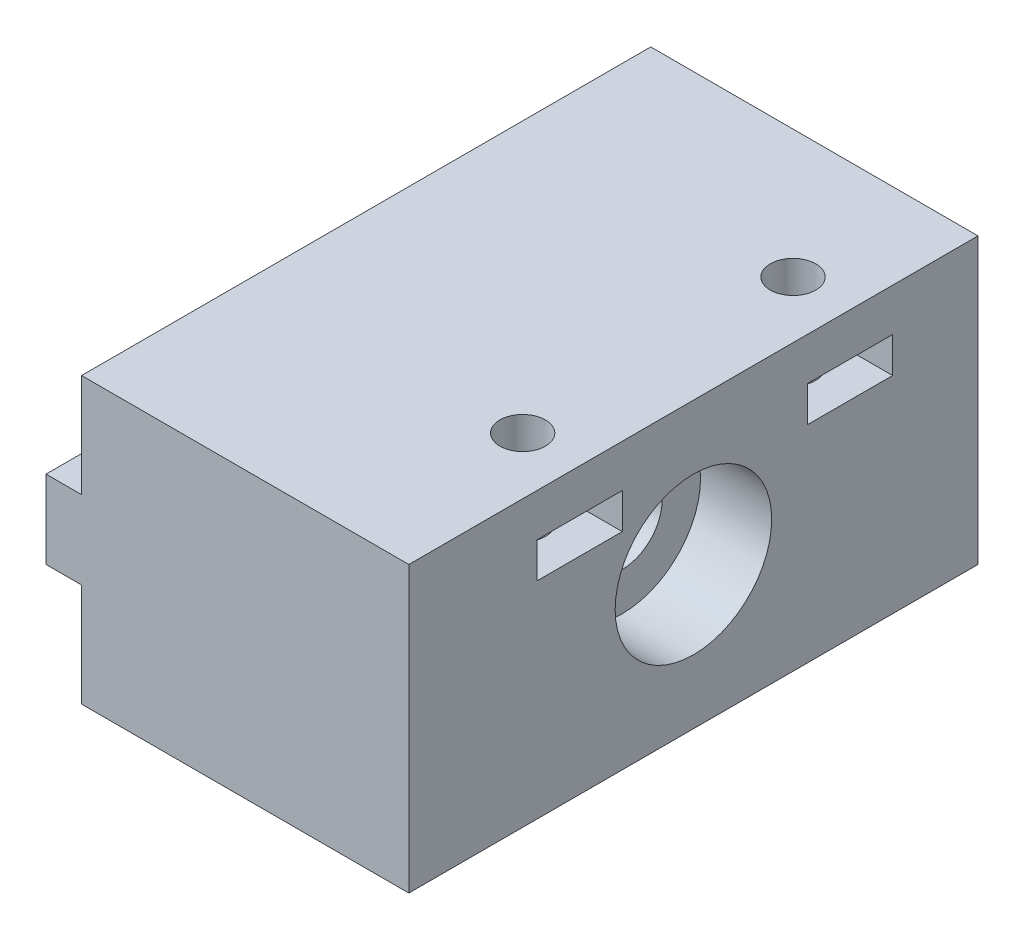
ISO-10303-21;
HEADER;
FILE_DESCRIPTION(('STEP AP214'),'2;1');
FILE_NAME('part.step','',(''),(''),'','','');
FILE_SCHEMA(('AUTOMOTIVE_DESIGN { 1 0 10303 214 1 1 1 1 }'));
ENDSEC;
DATA;
#1=APPLICATION_CONTEXT('core data for automotive mechanical design processes');
#2=APPLICATION_PROTOCOL_DEFINITION('international standard','automotive_design',2000,#1);
#3=PRODUCT_CONTEXT('',#1,'mechanical');
#4=PRODUCT('Part','Part','',(#3));
#5=PRODUCT_RELATED_PRODUCT_CATEGORY('part','',(#4));
#6=PRODUCT_DEFINITION_FORMATION('','',#4);
#7=PRODUCT_DEFINITION_CONTEXT('part definition',#1,'design');
#8=PRODUCT_DEFINITION('design','',#6,#7);
#9=PRODUCT_DEFINITION_SHAPE('','',#8);
#10=(LENGTH_UNIT() NAMED_UNIT(*) SI_UNIT(.MILLI.,.METRE.));
#11=(NAMED_UNIT(*) PLANE_ANGLE_UNIT() SI_UNIT($,.RADIAN.));
#12=(NAMED_UNIT(*) SI_UNIT($,.STERADIAN.) SOLID_ANGLE_UNIT());
#13=UNCERTAINTY_MEASURE_WITH_UNIT(LENGTH_MEASURE(1.E-05),#10,'distance_accuracy_value','');
#14=(GEOMETRIC_REPRESENTATION_CONTEXT(3) GLOBAL_UNCERTAINTY_ASSIGNED_CONTEXT((#13)) GLOBAL_UNIT_ASSIGNED_CONTEXT((#10,
#11,#12)) REPRESENTATION_CONTEXT('',''));
#15=CARTESIAN_POINT('',(0.,0.,0.));
#16=DIRECTION('',(0.,0.,1.));
#17=DIRECTION('',(1.,0.,0.));
#18=AXIS2_PLACEMENT_3D('',#15,#16,#17);
#19=CARTESIAN_POINT('',(-0.696758220439547,20.,0.));
#20=DIRECTION('',(1.,0.,0.));
#21=DIRECTION('',(0.,0.,-1.));
#22=AXIS2_PLACEMENT_3D('',#19,#20,#21);
#23=PLANE('',#22);
#24=CARTESIAN_POINT('',(-0.696758220439547,10.,-20.));
#25=DIRECTION('',(-1.,0.,0.));
#26=DIRECTION('',(0.,0.,1.));
#27=AXIS2_PLACEMENT_3D('',#24,#25,#26);
#28=CIRCLE('',#27,2.80000000000001);
#29=CARTESIAN_POINT('',(-0.696758220439547,10.,-17.2));
#30=VERTEX_POINT('',#29);
#31=EDGE_CURVE('E231',#30,#30,#28,.T.);
#32=ORIENTED_EDGE('',*,*,#31,.F.);
#33=EDGE_LOOP('',(#32));
#34=FACE_BOUND('',#33,.T.);
#35=DIRECTION('',(0.,0.,1.));
#36=VECTOR('',#35,1.);
#37=CARTESIAN_POINT('',(-0.696758220439547,7.25,-13.));
#38=LINE('',#37,#36);
#39=CARTESIAN_POINT('',(-0.696758220439547,7.25,-13.));
#40=VERTEX_POINT('',#39);
#41=CARTESIAN_POINT('',(-0.696758220439547,7.25,0.));
#42=VERTEX_POINT('',#41);
#43=EDGE_CURVE('E51',#40,#42,#38,.T.);
#44=ORIENTED_EDGE('',*,*,#43,.F.);
#45=DIRECTION('',(0.,-1.,0.));
#46=VECTOR('',#45,1.);
#47=CARTESIAN_POINT('',(-0.696758220439547,12.75,-13.));
#48=LINE('',#47,#46);
#49=CARTESIAN_POINT('',(-0.696758220439547,12.75,-13.));
#50=VERTEX_POINT('',#49);
#51=EDGE_CURVE('E190',#50,#40,#48,.T.);
#52=ORIENTED_EDGE('',*,*,#51,.F.);
#53=DIRECTION('',(0.,0.,-1.));
#54=VECTOR('',#53,1.);
#55=CARTESIAN_POINT('',(-0.696758220439547,12.75,-13.));
#56=LINE('',#55,#54);
#57=CARTESIAN_POINT('',(-0.696758220439547,12.75,0.));
#58=VERTEX_POINT('',#57);
#59=EDGE_CURVE('E382',#58,#50,#56,.T.);
#60=ORIENTED_EDGE('',*,*,#59,.F.);
#61=DIRECTION('',(0.,-1.,0.));
#62=VECTOR('',#61,1.);
#63=CARTESIAN_POINT('',(-0.696758220439547,20.,0.));
#64=LINE('',#63,#62);
#65=CARTESIAN_POINT('',(-0.696758220439547,20.,0.));
#66=VERTEX_POINT('',#65);
#67=EDGE_CURVE('E11',#66,#58,#64,.T.);
#68=ORIENTED_EDGE('',*,*,#67,.F.);
#69=DIRECTION('',(0.,0.,1.));
#70=VECTOR('',#69,1.);
#71=CARTESIAN_POINT('',(-0.696758220439547,20.,0.));
#72=LINE('',#71,#70);
#73=CARTESIAN_POINT('',(-0.696758220439547,20.,-40.));
#74=VERTEX_POINT('',#73);
#75=EDGE_CURVE('E315',#74,#66,#72,.T.);
#76=ORIENTED_EDGE('',*,*,#75,.F.);
#77=DIRECTION('',(0.,-1.,0.));
#78=VECTOR('',#77,1.);
#79=CARTESIAN_POINT('',(-0.696758220439547,20.,-40.));
#80=LINE('',#79,#78);
#81=CARTESIAN_POINT('',(-0.696758220439547,12.75,-40.));
#82=VERTEX_POINT('',#81);
#83=EDGE_CURVE('E334',#74,#82,#80,.T.);
#84=ORIENTED_EDGE('',*,*,#83,.T.);
#85=DIRECTION('',(0.,0.,-1.));
#86=VECTOR('',#85,1.);
#87=CARTESIAN_POINT('',(-0.696758220439547,12.75,-40.));
#88=LINE('',#87,#86);
#89=CARTESIAN_POINT('',(-0.696758220439547,12.75,-27.));
#90=VERTEX_POINT('',#89);
#91=EDGE_CURVE('E59',#90,#82,#88,.T.);
#92=ORIENTED_EDGE('',*,*,#91,.F.);
#93=DIRECTION('',(0.,1.,0.));
#94=VECTOR('',#93,1.);
#95=CARTESIAN_POINT('',(-0.696758220439547,12.75,-27.));
#96=LINE('',#95,#94);
#97=CARTESIAN_POINT('',(-0.696758220439547,7.25,-27.));
#98=VERTEX_POINT('',#97);
#99=EDGE_CURVE('E196',#98,#90,#96,.T.);
#100=ORIENTED_EDGE('',*,*,#99,.F.);
#101=DIRECTION('',(0.,0.,1.));
#102=VECTOR('',#101,1.);
#103=CARTESIAN_POINT('',(-0.696758220439547,7.25,-40.));
#104=LINE('',#103,#102);
#105=CARTESIAN_POINT('',(-0.696758220439547,7.25,-40.));
#106=VERTEX_POINT('',#105);
#107=EDGE_CURVE('E193',#106,#98,#104,.T.);
#108=ORIENTED_EDGE('',*,*,#107,.F.);
#109=CARTESIAN_POINT('',(-0.696758220439547,0.,-40.));
#110=VERTEX_POINT('',#109);
#111=EDGE_CURVE('E325',#106,#110,#80,.T.);
#112=ORIENTED_EDGE('',*,*,#111,.T.);
#113=DIRECTION('',(0.,0.,1.));
#114=VECTOR('',#113,1.);
#115=CARTESIAN_POINT('',(-0.696758220439547,0.,0.));
#116=LINE('',#115,#114);
#117=CARTESIAN_POINT('',(-0.696758220439547,0.,0.));
#118=VERTEX_POINT('',#117);
#119=EDGE_CURVE('E312',#110,#118,#116,.T.);
#120=ORIENTED_EDGE('',*,*,#119,.T.);
#121=EDGE_CURVE('E43',#42,#118,#64,.T.);
#122=ORIENTED_EDGE('',*,*,#121,.F.);
#123=EDGE_LOOP('',(#44,#52,#60,#68,#76,#84,#92,#100,#108,#112,#120,#122));
#124=FACE_BOUND('',#123,.T.);
#125=ADVANCED_FACE('F35',(#34,#124),#23,.F.);
#126=CARTESIAN_POINT('',(22.3032417795605,10.,-20.));
#127=DIRECTION('',(-1.,0.,0.));
#128=DIRECTION('',(0.,0.,1.));
#129=AXIS2_PLACEMENT_3D('',#126,#127,#128);
#130=CYLINDRICAL_SURFACE('',#129,2.80000000000001);
#131=ORIENTED_EDGE('',*,*,#31,.T.);
#132=EDGE_LOOP('',(#131));
#133=FACE_BOUND('',#132,.T.);
#134=CARTESIAN_POINT('',(17.3032417795605,10.,-20.));
#135=DIRECTION('',(1.,0.,0.));
#136=DIRECTION('',(0.,0.,-1.));
#137=AXIS2_PLACEMENT_3D('',#134,#135,#136);
#138=CIRCLE('',#137,2.80000000000001);
#139=CARTESIAN_POINT('',(17.3032417795605,10.,-22.8));
#140=VERTEX_POINT('',#139);
#141=EDGE_CURVE('E38',#140,#140,#138,.F.);
#142=ORIENTED_EDGE('',*,*,#141,.F.);
#143=EDGE_LOOP('',(#142));
#144=FACE_BOUND('',#143,.T.);
#145=ADVANCED_FACE('F372',(#133,#144),#130,.F.);
#146=CARTESIAN_POINT('',(18.3032417795604,0.,-31.));
#147=DIRECTION('',(0.,1.,0.));
#148=DIRECTION('',(0.,0.,1.));
#149=AXIS2_PLACEMENT_3D('',#146,#147,#148);
#150=CYLINDRICAL_SURFACE('',#149,1.60000000000001);
#151=CARTESIAN_POINT('',(18.3032417795604,17.,-31.));
#152=DIRECTION('',(0.,1.,0.));
#153=DIRECTION('',(0.,0.,1.));
#154=AXIS2_PLACEMENT_3D('',#151,#152,#153);
#155=CIRCLE('',#154,1.60000000000001);
#156=CARTESIAN_POINT('',(18.3032417795604,17.,-29.4));
#157=VERTEX_POINT('',#156);
#158=EDGE_CURVE('E284',#157,#157,#155,.F.);
#159=ORIENTED_EDGE('',*,*,#158,.T.);
#160=EDGE_LOOP('',(#159));
#161=FACE_BOUND('',#160,.T.);
#162=CARTESIAN_POINT('',(18.3032417795604,20.,-31.));
#163=DIRECTION('',(0.,1.,0.));
#164=DIRECTION('',(0.,0.,1.));
#165=AXIS2_PLACEMENT_3D('',#162,#163,#164);
#166=CIRCLE('',#165,1.60000000000001);
#167=CARTESIAN_POINT('',(18.3032417795604,20.,-29.4));
#168=VERTEX_POINT('',#167);
#169=EDGE_CURVE('E305',#168,#168,#166,.T.);
#170=ORIENTED_EDGE('',*,*,#169,.T.);
#171=EDGE_LOOP('',(#170));
#172=FACE_BOUND('',#171,.T.);
#173=ADVANCED_FACE('F350',(#161,#172),#150,.F.);
#174=CARTESIAN_POINT('',(18.3032417795605,0.,-12.));
#175=DIRECTION('',(0.,1.,0.));
#176=DIRECTION('',(0.,0.,1.));
#177=AXIS2_PLACEMENT_3D('',#174,#175,#176);
#178=CYLINDRICAL_SURFACE('',#177,1.6);
#179=CARTESIAN_POINT('',(18.3032417795605,17.,-12.));
#180=DIRECTION('',(0.,1.,0.));
#181=DIRECTION('',(0.,0.,1.));
#182=AXIS2_PLACEMENT_3D('',#179,#180,#181);
#183=CIRCLE('',#182,1.6);
#184=CARTESIAN_POINT('',(18.3032417795605,17.,-10.4));
#185=VERTEX_POINT('',#184);
#186=EDGE_CURVE('E308',#185,#185,#183,.F.);
#187=ORIENTED_EDGE('',*,*,#186,.T.);
#188=EDGE_LOOP('',(#187));
#189=FACE_BOUND('',#188,.T.);
#190=CARTESIAN_POINT('',(18.3032417795605,20.,-12.));
#191=DIRECTION('',(0.,1.,0.));
#192=DIRECTION('',(0.,0.,1.));
#193=AXIS2_PLACEMENT_3D('',#190,#191,#192);
#194=CIRCLE('',#193,1.6);
#195=CARTESIAN_POINT('',(18.3032417795605,20.,-10.4));
#196=VERTEX_POINT('',#195);
#197=EDGE_CURVE('E304',#196,#196,#194,.T.);
#198=ORIENTED_EDGE('',*,*,#197,.T.);
#199=EDGE_LOOP('',(#198));
#200=FACE_BOUND('',#199,.T.);
#201=ADVANCED_FACE('F483',(#189,#200),#178,.F.);
#202=CARTESIAN_POINT('',(-0.696758220439547,20.,0.));
#203=DIRECTION('',(0.,0.,-1.));
#204=DIRECTION('',(-1.,0.,0.));
#205=AXIS2_PLACEMENT_3D('',#202,#203,#204);
#206=PLANE('',#205);
#207=DIRECTION('',(1.,0.,0.));
#208=VECTOR('',#207,1.);
#209=CARTESIAN_POINT('',(-0.696758220439547,0.,0.));
#210=LINE('',#209,#208);
#211=CARTESIAN_POINT('',(22.3032417795605,0.,0.));
#212=VERTEX_POINT('',#211);
#213=EDGE_CURVE('E328',#118,#212,#210,.T.);
#214=ORIENTED_EDGE('',*,*,#213,.T.);
#215=DIRECTION('',(0.,-1.,0.));
#216=VECTOR('',#215,1.);
#217=CARTESIAN_POINT('',(22.3032417795605,20.,0.));
#218=LINE('',#217,#216);
#219=CARTESIAN_POINT('',(22.3032417795605,20.,0.));
#220=VERTEX_POINT('',#219);
#221=EDGE_CURVE('E339',#220,#212,#218,.T.);
#222=ORIENTED_EDGE('',*,*,#221,.F.);
#223=DIRECTION('',(1.,0.,0.));
#224=VECTOR('',#223,1.);
#225=CARTESIAN_POINT('',(-0.696758220439547,20.,0.));
#226=LINE('',#225,#224);
#227=EDGE_CURVE('E318',#66,#220,#226,.T.);
#228=ORIENTED_EDGE('',*,*,#227,.F.);
#229=ORIENTED_EDGE('',*,*,#67,.T.);
#230=DIRECTION('',(1.,0.,0.));
#231=VECTOR('',#230,1.);
#232=CARTESIAN_POINT('',(-3.19675822043955,12.75,0.));
#233=LINE('',#232,#231);
#234=CARTESIAN_POINT('',(-3.19675822043955,12.75,0.));
#235=VERTEX_POINT('',#234);
#236=EDGE_CURVE('E179',#235,#58,#233,.T.);
#237=ORIENTED_EDGE('',*,*,#236,.F.);
#238=DIRECTION('',(0.,1.,0.));
#239=VECTOR('',#238,1.);
#240=CARTESIAN_POINT('',(-3.19675822043955,12.75,0.));
#241=LINE('',#240,#239);
#242=CARTESIAN_POINT('',(-3.19675822043955,7.25,0.));
#243=VERTEX_POINT('',#242);
#244=EDGE_CURVE('E174',#243,#235,#241,.T.);
#245=ORIENTED_EDGE('',*,*,#244,.F.);
#246=DIRECTION('',(1.,0.,0.));
#247=VECTOR('',#246,1.);
#248=CARTESIAN_POINT('',(-3.19675822043955,7.25,0.));
#249=LINE('',#248,#247);
#250=EDGE_CURVE('E177',#243,#42,#249,.T.);
#251=ORIENTED_EDGE('',*,*,#250,.T.);
#252=ORIENTED_EDGE('',*,*,#121,.T.);
#253=EDGE_LOOP('',(#214,#222,#228,#229,#237,#245,#251,#252));
#254=FACE_BOUND('',#253,.T.);
#255=ADVANCED_FACE('F176',(#254),#206,.F.);
#256=CARTESIAN_POINT('',(22.3032417795605,20.,0.));
#257=DIRECTION('',(-1.,0.,0.));
#258=DIRECTION('',(0.,0.,1.));
#259=AXIS2_PLACEMENT_3D('',#256,#257,#258);
#260=PLANE('',#259);
#261=CARTESIAN_POINT('',(22.3032417795605,10.,-20.));
#262=DIRECTION('',(1.,0.,0.));
#263=DIRECTION('',(0.,0.,-1.));
#264=AXIS2_PLACEMENT_3D('',#261,#262,#263);
#265=CIRCLE('',#264,5.5);
#266=CARTESIAN_POINT('',(22.3032417795605,10.,-25.5));
#267=VERTEX_POINT('',#266);
#268=EDGE_CURVE('E225',#267,#267,#265,.T.);
#269=ORIENTED_EDGE('',*,*,#268,.F.);
#270=EDGE_LOOP('',(#269));
#271=FACE_BOUND('',#270,.T.);
#272=DIRECTION('',(0.,0.,-1.));
#273=VECTOR('',#272,1.);
#274=CARTESIAN_POINT('',(22.3032417795605,14.5,-28.));
#275=LINE('',#274,#273);
#276=CARTESIAN_POINT('',(22.3032417795605,14.5,-28.));
#277=VERTEX_POINT('',#276);
#278=CARTESIAN_POINT('',(22.3032417795605,14.5,-34.));
#279=VERTEX_POINT('',#278);
#280=EDGE_CURVE('E250',#277,#279,#275,.T.);
#281=ORIENTED_EDGE('',*,*,#280,.F.);
#282=DIRECTION('',(0.,-1.,0.));
#283=VECTOR('',#282,1.);
#284=CARTESIAN_POINT('',(22.3032417795605,17.,-28.));
#285=LINE('',#284,#283);
#286=CARTESIAN_POINT('',(22.3032417795605,17.,-28.));
#287=VERTEX_POINT('',#286);
#288=EDGE_CURVE('E234',#287,#277,#285,.T.);
#289=ORIENTED_EDGE('',*,*,#288,.F.);
#290=DIRECTION('',(0.,0.,1.));
#291=VECTOR('',#290,1.);
#292=CARTESIAN_POINT('',(22.3032417795605,17.,-28.));
#293=LINE('',#292,#291);
#294=CARTESIAN_POINT('',(22.3032417795605,17.,-34.));
#295=VERTEX_POINT('',#294);
#296=EDGE_CURVE('E239',#295,#287,#293,.T.);
#297=ORIENTED_EDGE('',*,*,#296,.F.);
#298=DIRECTION('',(0.,1.,0.));
#299=VECTOR('',#298,1.);
#300=CARTESIAN_POINT('',(22.3032417795605,17.,-34.));
#301=LINE('',#300,#299);
#302=EDGE_CURVE('E253',#279,#295,#301,.T.);
#303=ORIENTED_EDGE('',*,*,#302,.F.);
#304=EDGE_LOOP('',(#281,#289,#297,#303));
#305=FACE_BOUND('',#304,.T.);
#306=DIRECTION('',(0.,0.,-1.));
#307=VECTOR('',#306,1.);
#308=CARTESIAN_POINT('',(22.3032417795605,14.5,-9.));
#309=LINE('',#308,#307);
#310=CARTESIAN_POINT('',(22.3032417795605,14.5,-9.));
#311=VERTEX_POINT('',#310);
#312=CARTESIAN_POINT('',(22.3032417795605,14.5,-15.));
#313=VERTEX_POINT('',#312);
#314=EDGE_CURVE('E283',#311,#313,#309,.T.);
#315=ORIENTED_EDGE('',*,*,#314,.F.);
#316=DIRECTION('',(0.,-1.,0.));
#317=VECTOR('',#316,1.);
#318=CARTESIAN_POINT('',(22.3032417795605,17.,-9.));
#319=LINE('',#318,#317);
#320=CARTESIAN_POINT('',(22.3032417795605,17.,-9.));
#321=VERTEX_POINT('',#320);
#322=EDGE_CURVE('E281',#321,#311,#319,.T.);
#323=ORIENTED_EDGE('',*,*,#322,.F.);
#324=DIRECTION('',(0.,0.,1.));
#325=VECTOR('',#324,1.);
#326=CARTESIAN_POINT('',(22.3032417795605,17.,-9.));
#327=LINE('',#326,#325);
#328=CARTESIAN_POINT('',(22.3032417795605,17.,-15.));
#329=VERTEX_POINT('',#328);
#330=EDGE_CURVE('E271',#329,#321,#327,.T.);
#331=ORIENTED_EDGE('',*,*,#330,.F.);
#332=DIRECTION('',(0.,1.,0.));
#333=VECTOR('',#332,1.);
#334=CARTESIAN_POINT('',(22.3032417795605,17.,-15.));
#335=LINE('',#334,#333);
#336=EDGE_CURVE('E287',#313,#329,#335,.T.);
#337=ORIENTED_EDGE('',*,*,#336,.F.);
#338=EDGE_LOOP('',(#315,#323,#331,#337));
#339=FACE_BOUND('',#338,.T.);
#340=DIRECTION('',(0.,0.,-1.));
#341=VECTOR('',#340,1.);
#342=CARTESIAN_POINT('',(22.3032417795605,0.,0.));
#343=LINE('',#342,#341);
#344=CARTESIAN_POINT('',(22.3032417795605,0.,-40.));
#345=VERTEX_POINT('',#344);
#346=EDGE_CURVE('E330',#212,#345,#343,.T.);
#347=ORIENTED_EDGE('',*,*,#346,.T.);
#348=DIRECTION('',(0.,-1.,0.));
#349=VECTOR('',#348,1.);
#350=CARTESIAN_POINT('',(22.3032417795605,20.,-40.));
#351=LINE('',#350,#349);
#352=CARTESIAN_POINT('',(22.3032417795605,20.,-40.));
#353=VERTEX_POINT('',#352);
#354=EDGE_CURVE('E336',#353,#345,#351,.T.);
#355=ORIENTED_EDGE('',*,*,#354,.F.);
#356=DIRECTION('',(0.,0.,-1.));
#357=VECTOR('',#356,1.);
#358=CARTESIAN_POINT('',(22.3032417795605,20.,0.));
#359=LINE('',#358,#357);
#360=EDGE_CURVE('E321',#220,#353,#359,.T.);
#361=ORIENTED_EDGE('',*,*,#360,.F.);
#362=ORIENTED_EDGE('',*,*,#221,.T.);
#363=EDGE_LOOP('',(#347,#355,#361,#362));
#364=FACE_BOUND('',#363,.T.);
#365=ADVANCED_FACE('F456',(#271,#305,#339,#364),#260,.F.);
#366=CARTESIAN_POINT('',(-0.696758220439547,20.,-40.));
#367=DIRECTION('',(0.,0.,1.));
#368=DIRECTION('',(1.,0.,0.));
#369=AXIS2_PLACEMENT_3D('',#366,#367,#368);
#370=PLANE('',#369);
#371=DIRECTION('',(-1.,0.,0.));
#372=VECTOR('',#371,1.);
#373=CARTESIAN_POINT('',(-0.696758220439547,0.,-40.));
#374=LINE('',#373,#372);
#375=EDGE_CURVE('E319',#345,#110,#374,.T.);
#376=ORIENTED_EDGE('',*,*,#375,.T.);
#377=ORIENTED_EDGE('',*,*,#111,.F.);
#378=DIRECTION('',(1.,0.,0.));
#379=VECTOR('',#378,1.);
#380=CARTESIAN_POINT('',(-3.19675822043955,7.25,-40.));
#381=LINE('',#380,#379);
#382=CARTESIAN_POINT('',(-3.19675822043955,7.25,-40.));
#383=VERTEX_POINT('',#382);
#384=EDGE_CURVE('E222',#383,#106,#381,.T.);
#385=ORIENTED_EDGE('',*,*,#384,.F.);
#386=DIRECTION('',(0.,-1.,0.));
#387=VECTOR('',#386,1.);
#388=CARTESIAN_POINT('',(-3.19675822043955,12.75,-40.));
#389=LINE('',#388,#387);
#390=CARTESIAN_POINT('',(-3.19675822043955,12.75,-40.));
#391=VERTEX_POINT('',#390);
#392=EDGE_CURVE('E202',#391,#383,#389,.T.);
#393=ORIENTED_EDGE('',*,*,#392,.F.);
#394=DIRECTION('',(1.,0.,0.));
#395=VECTOR('',#394,1.);
#396=CARTESIAN_POINT('',(-3.19675822043955,12.75,-40.));
#397=LINE('',#396,#395);
#398=EDGE_CURVE('E210',#391,#82,#397,.T.);
#399=ORIENTED_EDGE('',*,*,#398,.T.);
#400=ORIENTED_EDGE('',*,*,#83,.F.);
#401=DIRECTION('',(-1.,0.,0.));
#402=VECTOR('',#401,1.);
#403=CARTESIAN_POINT('',(-0.696758220439547,20.,-40.));
#404=LINE('',#403,#402);
#405=EDGE_CURVE('E323',#353,#74,#404,.T.);
#406=ORIENTED_EDGE('',*,*,#405,.F.);
#407=ORIENTED_EDGE('',*,*,#354,.T.);
#408=EDGE_LOOP('',(#376,#377,#385,#393,#399,#400,#406,#407));
#409=FACE_BOUND('',#408,.T.);
#410=ADVANCED_FACE('F411',(#409),#370,.F.);
#411=CARTESIAN_POINT('',(0.,20.,0.));
#412=DIRECTION('',(0.,-1.,0.));
#413=DIRECTION('',(0.,0.,-1.));
#414=AXIS2_PLACEMENT_3D('',#411,#412,#413);
#415=PLANE('',#414);
#416=ORIENTED_EDGE('',*,*,#169,.F.);
#417=EDGE_LOOP('',(#416));
#418=FACE_BOUND('',#417,.T.);
#419=ORIENTED_EDGE('',*,*,#197,.F.);
#420=EDGE_LOOP('',(#419));
#421=FACE_BOUND('',#420,.T.);
#422=ORIENTED_EDGE('',*,*,#75,.T.);
#423=ORIENTED_EDGE('',*,*,#227,.T.);
#424=ORIENTED_EDGE('',*,*,#360,.T.);
#425=ORIENTED_EDGE('',*,*,#405,.T.);
#426=EDGE_LOOP('',(#422,#423,#424,#425));
#427=FACE_BOUND('',#426,.T.);
#428=ADVANCED_FACE('F401',(#418,#421,#427),#415,.F.);
#429=CARTESIAN_POINT('',(0.,0.,0.));
#430=DIRECTION('',(0.,-1.,0.));
#431=DIRECTION('',(0.,0.,-1.));
#432=AXIS2_PLACEMENT_3D('',#429,#430,#431);
#433=PLANE('',#432);
#434=CARTESIAN_POINT('',(18.3032417795604,0.,-31.));
#435=DIRECTION('',(0.,1.,0.));
#436=DIRECTION('',(0.,0.,1.));
#437=AXIS2_PLACEMENT_3D('',#434,#435,#436);
#438=CIRCLE('',#437,1.60000000000001);
#439=CARTESIAN_POINT('',(18.3032417795604,0.,-29.4));
#440=VERTEX_POINT('',#439);
#441=EDGE_CURVE('E301',#440,#440,#438,.T.);
#442=ORIENTED_EDGE('',*,*,#441,.T.);
#443=EDGE_LOOP('',(#442));
#444=FACE_BOUND('',#443,.T.);
#445=CARTESIAN_POINT('',(18.3032417795605,0.,-12.));
#446=DIRECTION('',(0.,1.,0.));
#447=DIRECTION('',(0.,0.,1.));
#448=AXIS2_PLACEMENT_3D('',#445,#446,#447);
#449=CIRCLE('',#448,1.6);
#450=CARTESIAN_POINT('',(18.3032417795605,0.,-10.4));
#451=VERTEX_POINT('',#450);
#452=EDGE_CURVE('E309',#451,#451,#449,.T.);
#453=ORIENTED_EDGE('',*,*,#452,.T.);
#454=EDGE_LOOP('',(#453));
#455=FACE_BOUND('',#454,.T.);
#456=ORIENTED_EDGE('',*,*,#119,.F.);
#457=ORIENTED_EDGE('',*,*,#375,.F.);
#458=ORIENTED_EDGE('',*,*,#346,.F.);
#459=ORIENTED_EDGE('',*,*,#213,.F.);
#460=EDGE_LOOP('',(#456,#457,#458,#459));
#461=FACE_BOUND('',#460,.T.);
#462=ADVANCED_FACE('F471',(#444,#455,#461),#433,.T.);
#463=CARTESIAN_POINT('',(18.3032417795605,14.5,-12.));
#464=DIRECTION('',(0.,-1.,0.));
#465=DIRECTION('',(0.,0.,-1.));
#466=AXIS2_PLACEMENT_3D('',#463,#464,#465);
#467=CIRCLE('',#466,1.6);
#468=CARTESIAN_POINT('',(18.3032417795605,14.5,-13.6));
#469=VERTEX_POINT('',#468);
#470=EDGE_CURVE('E294',#469,#469,#467,.F.);
#471=ORIENTED_EDGE('',*,*,#470,.T.);
#472=EDGE_LOOP('',(#471));
#473=FACE_BOUND('',#472,.T.);
#474=ORIENTED_EDGE('',*,*,#452,.F.);
#475=EDGE_LOOP('',(#474));
#476=FACE_BOUND('',#475,.T.);
#477=ADVANCED_FACE('F473',(#473,#476),#178,.F.);
#478=CARTESIAN_POINT('',(18.3032417795604,14.5,-31.));
#479=DIRECTION('',(0.,-1.,0.));
#480=DIRECTION('',(0.,0.,-1.));
#481=AXIS2_PLACEMENT_3D('',#478,#479,#480);
#482=CIRCLE('',#481,1.60000000000001);
#483=CARTESIAN_POINT('',(18.3032417795604,14.5,-32.6));
#484=VERTEX_POINT('',#483);
#485=EDGE_CURVE('E260',#484,#484,#482,.F.);
#486=ORIENTED_EDGE('',*,*,#485,.T.);
#487=EDGE_LOOP('',(#486));
#488=FACE_BOUND('',#487,.T.);
#489=ORIENTED_EDGE('',*,*,#441,.F.);
#490=EDGE_LOOP('',(#489));
#491=FACE_BOUND('',#490,.T.);
#492=ADVANCED_FACE('F480',(#488,#491),#150,.F.);
#493=CARTESIAN_POINT('',(14.3032417795605,17.,-9.));
#494=DIRECTION('',(0.,1.,0.));
#495=DIRECTION('',(0.,0.,1.));
#496=AXIS2_PLACEMENT_3D('',#493,#494,#495);
#497=PLANE('',#496);
#498=ORIENTED_EDGE('',*,*,#330,.T.);
#499=DIRECTION('',(1.,0.,0.));
#500=VECTOR('',#499,1.);
#501=CARTESIAN_POINT('',(14.3032417795605,17.,-9.));
#502=LINE('',#501,#500);
#503=CARTESIAN_POINT('',(14.3032417795605,17.,-9.));
#504=VERTEX_POINT('',#503);
#505=EDGE_CURVE('E292',#504,#321,#502,.T.);
#506=ORIENTED_EDGE('',*,*,#505,.F.);
#507=DIRECTION('',(0.,0.,1.));
#508=VECTOR('',#507,1.);
#509=CARTESIAN_POINT('',(14.3032417795605,17.,-9.));
#510=LINE('',#509,#508);
#511=CARTESIAN_POINT('',(14.3032417795605,17.,-15.));
#512=VERTEX_POINT('',#511);
#513=EDGE_CURVE('E277',#512,#504,#510,.T.);
#514=ORIENTED_EDGE('',*,*,#513,.F.);
#515=DIRECTION('',(1.,0.,0.));
#516=VECTOR('',#515,1.);
#517=CARTESIAN_POINT('',(14.3032417795605,17.,-15.));
#518=LINE('',#517,#516);
#519=EDGE_CURVE('E295',#512,#329,#518,.T.);
#520=ORIENTED_EDGE('',*,*,#519,.T.);
#521=EDGE_LOOP('',(#498,#506,#514,#520));
#522=FACE_BOUND('',#521,.T.);
#523=ORIENTED_EDGE('',*,*,#186,.F.);
#524=EDGE_LOOP('',(#523));
#525=FACE_BOUND('',#524,.T.);
#526=ADVANCED_FACE('F501',(#522,#525),#497,.F.);
#527=CARTESIAN_POINT('',(14.3032417795605,14.5,-9.));
#528=DIRECTION('',(0.,-1.,0.));
#529=DIRECTION('',(0.,0.,-1.));
#530=AXIS2_PLACEMENT_3D('',#527,#528,#529);
#531=PLANE('',#530);
#532=ORIENTED_EDGE('',*,*,#314,.T.);
#533=DIRECTION('',(1.,0.,0.));
#534=VECTOR('',#533,1.);
#535=CARTESIAN_POINT('',(14.3032417795605,14.5,-15.));
#536=LINE('',#535,#534);
#537=CARTESIAN_POINT('',(14.3032417795605,14.5,-15.));
#538=VERTEX_POINT('',#537);
#539=EDGE_CURVE('E297',#538,#313,#536,.T.);
#540=ORIENTED_EDGE('',*,*,#539,.F.);
#541=DIRECTION('',(0.,0.,-1.));
#542=VECTOR('',#541,1.);
#543=CARTESIAN_POINT('',(14.3032417795605,14.5,-9.));
#544=LINE('',#543,#542);
#545=CARTESIAN_POINT('',(14.3032417795605,14.5,-9.));
#546=VERTEX_POINT('',#545);
#547=EDGE_CURVE('E270',#546,#538,#544,.T.);
#548=ORIENTED_EDGE('',*,*,#547,.F.);
#549=DIRECTION('',(1.,0.,0.));
#550=VECTOR('',#549,1.);
#551=CARTESIAN_POINT('',(14.3032417795605,14.5,-9.));
#552=LINE('',#551,#550);
#553=EDGE_CURVE('E280',#546,#311,#552,.T.);
#554=ORIENTED_EDGE('',*,*,#553,.T.);
#555=EDGE_LOOP('',(#532,#540,#548,#554));
#556=FACE_BOUND('',#555,.T.);
#557=ORIENTED_EDGE('',*,*,#470,.F.);
#558=EDGE_LOOP('',(#557));
#559=FACE_BOUND('',#558,.T.);
#560=ADVANCED_FACE('F506',(#556,#559),#531,.F.);
#561=CARTESIAN_POINT('',(14.3032417795605,17.,-9.));
#562=DIRECTION('',(0.,0.,1.));
#563=DIRECTION('',(0.,-1.,0.));
#564=AXIS2_PLACEMENT_3D('',#561,#562,#563);
#565=PLANE('',#564);
#566=ORIENTED_EDGE('',*,*,#322,.T.);
#567=ORIENTED_EDGE('',*,*,#553,.F.);
#568=DIRECTION('',(0.,-1.,0.));
#569=VECTOR('',#568,1.);
#570=CARTESIAN_POINT('',(14.3032417795605,17.,-9.));
#571=LINE('',#570,#569);
#572=EDGE_CURVE('E267',#504,#546,#571,.T.);
#573=ORIENTED_EDGE('',*,*,#572,.F.);
#574=ORIENTED_EDGE('',*,*,#505,.T.);
#575=EDGE_LOOP('',(#566,#567,#573,#574));
#576=FACE_BOUND('',#575,.T.);
#577=ADVANCED_FACE('F503',(#576),#565,.F.);
#578=CARTESIAN_POINT('',(14.3032417795605,17.,-15.));
#579=DIRECTION('',(0.,0.,-1.));
#580=DIRECTION('',(0.,1.,0.));
#581=AXIS2_PLACEMENT_3D('',#578,#579,#580);
#582=PLANE('',#581);
#583=ORIENTED_EDGE('',*,*,#336,.T.);
#584=ORIENTED_EDGE('',*,*,#519,.F.);
#585=DIRECTION('',(0.,1.,0.));
#586=VECTOR('',#585,1.);
#587=CARTESIAN_POINT('',(14.3032417795605,17.,-15.));
#588=LINE('',#587,#586);
#589=EDGE_CURVE('E274',#538,#512,#588,.T.);
#590=ORIENTED_EDGE('',*,*,#589,.F.);
#591=ORIENTED_EDGE('',*,*,#539,.T.);
#592=EDGE_LOOP('',(#583,#584,#590,#591));
#593=FACE_BOUND('',#592,.T.);
#594=ADVANCED_FACE('F366',(#593),#582,.F.);
#595=CARTESIAN_POINT('',(14.3032417795605,0.,0.));
#596=DIRECTION('',(1.,0.,0.));
#597=DIRECTION('',(0.,0.,-1.));
#598=AXIS2_PLACEMENT_3D('',#595,#596,#597);
#599=PLANE('',#598);
#600=ORIENTED_EDGE('',*,*,#572,.T.);
#601=ORIENTED_EDGE('',*,*,#547,.T.);
#602=ORIENTED_EDGE('',*,*,#589,.T.);
#603=ORIENTED_EDGE('',*,*,#513,.T.);
#604=EDGE_LOOP('',(#600,#601,#602,#603));
#605=FACE_BOUND('',#604,.T.);
#606=ADVANCED_FACE('F356',(#605),#599,.T.);
#607=CARTESIAN_POINT('',(14.3032417795605,17.,-28.));
#608=DIRECTION('',(0.,1.,0.));
#609=DIRECTION('',(0.,0.,1.));
#610=AXIS2_PLACEMENT_3D('',#607,#608,#609);
#611=PLANE('',#610);
#612=ORIENTED_EDGE('',*,*,#296,.T.);
#613=DIRECTION('',(1.,0.,0.));
#614=VECTOR('',#613,1.);
#615=CARTESIAN_POINT('',(14.3032417795605,17.,-28.));
#616=LINE('',#615,#614);
#617=CARTESIAN_POINT('',(14.3032417795605,17.,-28.));
#618=VERTEX_POINT('',#617);
#619=EDGE_CURVE('E258',#618,#287,#616,.T.);
#620=ORIENTED_EDGE('',*,*,#619,.F.);
#621=DIRECTION('',(0.,0.,1.));
#622=VECTOR('',#621,1.);
#623=CARTESIAN_POINT('',(14.3032417795605,17.,-28.));
#624=LINE('',#623,#622);
#625=CARTESIAN_POINT('',(14.3032417795605,17.,-34.));
#626=VERTEX_POINT('',#625);
#627=EDGE_CURVE('E245',#626,#618,#624,.T.);
#628=ORIENTED_EDGE('',*,*,#627,.F.);
#629=DIRECTION('',(1.,0.,0.));
#630=VECTOR('',#629,1.);
#631=CARTESIAN_POINT('',(14.3032417795605,17.,-34.));
#632=LINE('',#631,#630);
#633=EDGE_CURVE('E261',#626,#295,#632,.T.);
#634=ORIENTED_EDGE('',*,*,#633,.T.);
#635=EDGE_LOOP('',(#612,#620,#628,#634));
#636=FACE_BOUND('',#635,.T.);
#637=ORIENTED_EDGE('',*,*,#158,.F.);
#638=EDGE_LOOP('',(#637));
#639=FACE_BOUND('',#638,.T.);
#640=ADVANCED_FACE('F353',(#636,#639),#611,.F.);
#641=CARTESIAN_POINT('',(14.3032417795605,14.5,-28.));
#642=DIRECTION('',(0.,-1.,0.));
#643=DIRECTION('',(0.,0.,-1.));
#644=AXIS2_PLACEMENT_3D('',#641,#642,#643);
#645=PLANE('',#644);
#646=ORIENTED_EDGE('',*,*,#280,.T.);
#647=DIRECTION('',(1.,0.,0.));
#648=VECTOR('',#647,1.);
#649=CARTESIAN_POINT('',(14.3032417795605,14.5,-34.));
#650=LINE('',#649,#648);
#651=CARTESIAN_POINT('',(14.3032417795605,14.5,-34.));
#652=VERTEX_POINT('',#651);
#653=EDGE_CURVE('E263',#652,#279,#650,.T.);
#654=ORIENTED_EDGE('',*,*,#653,.F.);
#655=DIRECTION('',(0.,0.,-1.));
#656=VECTOR('',#655,1.);
#657=CARTESIAN_POINT('',(14.3032417795605,14.5,-28.));
#658=LINE('',#657,#656);
#659=CARTESIAN_POINT('',(14.3032417795605,14.5,-28.));
#660=VERTEX_POINT('',#659);
#661=EDGE_CURVE('E238',#660,#652,#658,.T.);
#662=ORIENTED_EDGE('',*,*,#661,.F.);
#663=DIRECTION('',(1.,0.,0.));
#664=VECTOR('',#663,1.);
#665=CARTESIAN_POINT('',(14.3032417795605,14.5,-28.));
#666=LINE('',#665,#664);
#667=EDGE_CURVE('E248',#660,#277,#666,.T.);
#668=ORIENTED_EDGE('',*,*,#667,.T.);
#669=EDGE_LOOP('',(#646,#654,#662,#668));
#670=FACE_BOUND('',#669,.T.);
#671=ORIENTED_EDGE('',*,*,#485,.F.);
#672=EDGE_LOOP('',(#671));
#673=FACE_BOUND('',#672,.T.);
#674=ADVANCED_FACE('F355',(#670,#673),#645,.F.);
#675=CARTESIAN_POINT('',(14.3032417795605,17.,-28.));
#676=DIRECTION('',(0.,0.,1.));
#677=DIRECTION('',(1.,0.,0.));
#678=AXIS2_PLACEMENT_3D('',#675,#676,#677);
#679=PLANE('',#678);
#680=ORIENTED_EDGE('',*,*,#288,.T.);
#681=ORIENTED_EDGE('',*,*,#667,.F.);
#682=DIRECTION('',(0.,-1.,0.));
#683=VECTOR('',#682,1.);
#684=CARTESIAN_POINT('',(14.3032417795605,17.,-28.));
#685=LINE('',#684,#683);
#686=EDGE_CURVE('E235',#618,#660,#685,.T.);
#687=ORIENTED_EDGE('',*,*,#686,.F.);
#688=ORIENTED_EDGE('',*,*,#619,.T.);
#689=EDGE_LOOP('',(#680,#681,#687,#688));
#690=FACE_BOUND('',#689,.T.);
#691=ADVANCED_FACE('F363',(#690),#679,.F.);
#692=CARTESIAN_POINT('',(14.3032417795605,17.,-34.));
#693=DIRECTION('',(0.,0.,-1.));
#694=DIRECTION('',(-1.,0.,0.));
#695=AXIS2_PLACEMENT_3D('',#692,#693,#694);
#696=PLANE('',#695);
#697=ORIENTED_EDGE('',*,*,#302,.T.);
#698=ORIENTED_EDGE('',*,*,#633,.F.);
#699=DIRECTION('',(0.,1.,0.));
#700=VECTOR('',#699,1.);
#701=CARTESIAN_POINT('',(14.3032417795605,17.,-34.));
#702=LINE('',#701,#700);
#703=EDGE_CURVE('E242',#652,#626,#702,.T.);
#704=ORIENTED_EDGE('',*,*,#703,.F.);
#705=ORIENTED_EDGE('',*,*,#653,.T.);
#706=EDGE_LOOP('',(#697,#698,#704,#705));
#707=FACE_BOUND('',#706,.T.);
#708=ADVANCED_FACE('F439',(#707),#696,.F.);
#709=CARTESIAN_POINT('',(14.3032417795605,0.,0.));
#710=DIRECTION('',(1.,0.,0.));
#711=DIRECTION('',(0.,0.,-1.));
#712=AXIS2_PLACEMENT_3D('',#709,#710,#711);
#713=PLANE('',#712);
#714=ORIENTED_EDGE('',*,*,#686,.T.);
#715=ORIENTED_EDGE('',*,*,#661,.T.);
#716=ORIENTED_EDGE('',*,*,#703,.T.);
#717=ORIENTED_EDGE('',*,*,#627,.T.);
#718=EDGE_LOOP('',(#714,#715,#716,#717));
#719=FACE_BOUND('',#718,.T.);
#720=ADVANCED_FACE('F436',(#719),#713,.T.);
#721=CARTESIAN_POINT('',(17.3032417795605,10.,-20.));
#722=DIRECTION('',(1.,0.,0.));
#723=DIRECTION('',(0.,0.,-1.));
#724=AXIS2_PLACEMENT_3D('',#721,#722,#723);
#725=PLANE('',#724);
#726=CARTESIAN_POINT('',(17.3032417795605,10.,-20.));
#727=DIRECTION('',(1.,0.,0.));
#728=DIRECTION('',(0.,0.,-1.));
#729=AXIS2_PLACEMENT_3D('',#726,#727,#728);
#730=CIRCLE('',#729,5.5);
#731=CARTESIAN_POINT('',(17.3032417795605,10.,-25.5));
#732=VERTEX_POINT('',#731);
#733=EDGE_CURVE('E226',#732,#732,#730,.T.);
#734=ORIENTED_EDGE('',*,*,#733,.T.);
#735=EDGE_LOOP('',(#734));
#736=FACE_BOUND('',#735,.T.);
#737=ORIENTED_EDGE('',*,*,#141,.T.);
#738=EDGE_LOOP('',(#737));
#739=FACE_BOUND('',#738,.T.);
#740=ADVANCED_FACE('F430',(#736,#739),#725,.T.);
#741=CARTESIAN_POINT('',(17.3032417795605,10.,-20.));
#742=DIRECTION('',(1.,0.,0.));
#743=DIRECTION('',(0.,0.,-1.));
#744=AXIS2_PLACEMENT_3D('',#741,#742,#743);
#745=CYLINDRICAL_SURFACE('',#744,5.5);
#746=ORIENTED_EDGE('',*,*,#733,.F.);
#747=EDGE_LOOP('',(#746));
#748=FACE_BOUND('',#747,.T.);
#749=ORIENTED_EDGE('',*,*,#268,.T.);
#750=EDGE_LOOP('',(#749));
#751=FACE_BOUND('',#750,.T.);
#752=ADVANCED_FACE('F423',(#748,#751),#745,.F.);
#753=CARTESIAN_POINT('',(-3.19675822043955,7.25,-40.));
#754=DIRECTION('',(0.,1.,0.));
#755=DIRECTION('',(0.,0.,1.));
#756=AXIS2_PLACEMENT_3D('',#753,#754,#755);
#757=PLANE('',#756);
#758=ORIENTED_EDGE('',*,*,#107,.T.);
#759=DIRECTION('',(1.,0.,0.));
#760=VECTOR('',#759,1.);
#761=CARTESIAN_POINT('',(-3.19675822043955,7.25,-27.));
#762=LINE('',#761,#760);
#763=CARTESIAN_POINT('',(-3.19675822043955,7.25,-27.));
#764=VERTEX_POINT('',#763);
#765=EDGE_CURVE('E219',#764,#98,#762,.T.);
#766=ORIENTED_EDGE('',*,*,#765,.F.);
#767=DIRECTION('',(0.,0.,1.));
#768=VECTOR('',#767,1.);
#769=CARTESIAN_POINT('',(-3.19675822043955,7.25,-40.));
#770=LINE('',#769,#768);
#771=EDGE_CURVE('E205',#383,#764,#770,.T.);
#772=ORIENTED_EDGE('',*,*,#771,.F.);
#773=ORIENTED_EDGE('',*,*,#384,.T.);
#774=EDGE_LOOP('',(#758,#766,#772,#773));
#775=FACE_BOUND('',#774,.T.);
#776=ADVANCED_FACE('F421',(#775),#757,.F.);
#777=CARTESIAN_POINT('',(-3.19675822043955,12.75,-27.));
#778=DIRECTION('',(0.,0.,-1.));
#779=DIRECTION('',(-1.,0.,0.));
#780=AXIS2_PLACEMENT_3D('',#777,#778,#779);
#781=PLANE('',#780);
#782=ORIENTED_EDGE('',*,*,#99,.T.);
#783=DIRECTION('',(1.,0.,0.));
#784=VECTOR('',#783,1.);
#785=CARTESIAN_POINT('',(-3.19675822043955,12.75,-27.));
#786=LINE('',#785,#784);
#787=CARTESIAN_POINT('',(-3.19675822043955,12.75,-27.));
#788=VERTEX_POINT('',#787);
#789=EDGE_CURVE('E216',#788,#90,#786,.T.);
#790=ORIENTED_EDGE('',*,*,#789,.F.);
#791=DIRECTION('',(0.,1.,0.));
#792=VECTOR('',#791,1.);
#793=CARTESIAN_POINT('',(-3.19675822043955,12.75,-27.));
#794=LINE('',#793,#792);
#795=EDGE_CURVE('E207',#764,#788,#794,.T.);
#796=ORIENTED_EDGE('',*,*,#795,.F.);
#797=ORIENTED_EDGE('',*,*,#765,.T.);
#798=EDGE_LOOP('',(#782,#790,#796,#797));
#799=FACE_BOUND('',#798,.T.);
#800=ADVANCED_FACE('F419',(#799),#781,.F.);
#801=CARTESIAN_POINT('',(-3.19675822043955,12.75,-40.));
#802=DIRECTION('',(0.,-1.,0.));
#803=DIRECTION('',(0.,0.,-1.));
#804=AXIS2_PLACEMENT_3D('',#801,#802,#803);
#805=PLANE('',#804);
#806=ORIENTED_EDGE('',*,*,#91,.T.);
#807=ORIENTED_EDGE('',*,*,#398,.F.);
#808=DIRECTION('',(0.,0.,-1.));
#809=VECTOR('',#808,1.);
#810=CARTESIAN_POINT('',(-3.19675822043955,12.75,-40.));
#811=LINE('',#810,#809);
#812=EDGE_CURVE('E209',#788,#391,#811,.T.);
#813=ORIENTED_EDGE('',*,*,#812,.F.);
#814=ORIENTED_EDGE('',*,*,#789,.T.);
#815=EDGE_LOOP('',(#806,#807,#813,#814));
#816=FACE_BOUND('',#815,.T.);
#817=ADVANCED_FACE('F407',(#816),#805,.F.);
#818=CARTESIAN_POINT('',(-3.19675822043955,0.,0.));
#819=DIRECTION('',(-1.,0.,0.));
#820=DIRECTION('',(0.,0.,1.));
#821=AXIS2_PLACEMENT_3D('',#818,#819,#820);
#822=PLANE('',#821);
#823=ORIENTED_EDGE('',*,*,#392,.T.);
#824=ORIENTED_EDGE('',*,*,#771,.T.);
#825=ORIENTED_EDGE('',*,*,#795,.T.);
#826=ORIENTED_EDGE('',*,*,#812,.T.);
#827=EDGE_LOOP('',(#823,#824,#825,#826));
#828=FACE_BOUND('',#827,.T.);
#829=ADVANCED_FACE('F415',(#828),#822,.T.);
#830=CARTESIAN_POINT('',(-3.19675822043955,7.25,-13.));
#831=DIRECTION('',(0.,1.,0.));
#832=DIRECTION('',(0.,0.,1.));
#833=AXIS2_PLACEMENT_3D('',#830,#831,#832);
#834=PLANE('',#833);
#835=ORIENTED_EDGE('',*,*,#43,.T.);
#836=ORIENTED_EDGE('',*,*,#250,.F.);
#837=DIRECTION('',(0.,0.,1.));
#838=VECTOR('',#837,1.);
#839=CARTESIAN_POINT('',(-3.19675822043955,7.25,-13.));
#840=LINE('',#839,#838);
#841=CARTESIAN_POINT('',(-3.19675822043955,7.25,-13.));
#842=VERTEX_POINT('',#841);
#843=EDGE_CURVE('E183',#842,#243,#840,.T.);
#844=ORIENTED_EDGE('',*,*,#843,.F.);
#845=DIRECTION('',(1.,0.,0.));
#846=VECTOR('',#845,1.);
#847=CARTESIAN_POINT('',(-3.19675822043955,7.25,-13.));
#848=LINE('',#847,#846);
#849=EDGE_CURVE('E389',#842,#40,#848,.T.);
#850=ORIENTED_EDGE('',*,*,#849,.T.);
#851=EDGE_LOOP('',(#835,#836,#844,#850));
#852=FACE_BOUND('',#851,.T.);
#853=ADVANCED_FACE('F192',(#852),#834,.F.);
#854=CARTESIAN_POINT('',(-3.19675822043955,12.75,-13.));
#855=DIRECTION('',(0.,-1.,0.));
#856=DIRECTION('',(0.,0.,-1.));
#857=AXIS2_PLACEMENT_3D('',#854,#855,#856);
#858=PLANE('',#857);
#859=ORIENTED_EDGE('',*,*,#59,.T.);
#860=DIRECTION('',(1.,0.,0.));
#861=VECTOR('',#860,1.);
#862=CARTESIAN_POINT('',(-3.19675822043955,12.75,-13.));
#863=LINE('',#862,#861);
#864=CARTESIAN_POINT('',(-3.19675822043955,12.75,-13.));
#865=VERTEX_POINT('',#864);
#866=EDGE_CURVE('E198',#865,#50,#863,.T.);
#867=ORIENTED_EDGE('',*,*,#866,.F.);
#868=DIRECTION('',(0.,0.,-1.));
#869=VECTOR('',#868,1.);
#870=CARTESIAN_POINT('',(-3.19675822043955,12.75,-13.));
#871=LINE('',#870,#869);
#872=EDGE_CURVE('E182',#235,#865,#871,.T.);
#873=ORIENTED_EDGE('',*,*,#872,.F.);
#874=ORIENTED_EDGE('',*,*,#236,.T.);
#875=EDGE_LOOP('',(#859,#867,#873,#874));
#876=FACE_BOUND('',#875,.T.);
#877=ADVANCED_FACE('F395',(#876),#858,.F.);
#878=CARTESIAN_POINT('',(-3.19675822043955,12.75,-13.));
#879=DIRECTION('',(0.,0.,1.));
#880=DIRECTION('',(1.,0.,0.));
#881=AXIS2_PLACEMENT_3D('',#878,#879,#880);
#882=PLANE('',#881);
#883=ORIENTED_EDGE('',*,*,#51,.T.);
#884=ORIENTED_EDGE('',*,*,#849,.F.);
#885=DIRECTION('',(0.,-1.,0.));
#886=VECTOR('',#885,1.);
#887=CARTESIAN_POINT('',(-3.19675822043955,12.75,-13.));
#888=LINE('',#887,#886);
#889=EDGE_CURVE('E188',#865,#842,#888,.T.);
#890=ORIENTED_EDGE('',*,*,#889,.F.);
#891=ORIENTED_EDGE('',*,*,#866,.T.);
#892=EDGE_LOOP('',(#883,#884,#890,#891));
#893=FACE_BOUND('',#892,.T.);
#894=ADVANCED_FACE('F393',(#893),#882,.F.);
#895=CARTESIAN_POINT('',(-3.19675822043955,0.,0.));
#896=DIRECTION('',(1.,0.,0.));
#897=DIRECTION('',(0.,0.,-1.));
#898=AXIS2_PLACEMENT_3D('',#895,#896,#897);
#899=PLANE('',#898);
#900=ORIENTED_EDGE('',*,*,#843,.T.);
#901=ORIENTED_EDGE('',*,*,#244,.T.);
#902=ORIENTED_EDGE('',*,*,#872,.T.);
#903=ORIENTED_EDGE('',*,*,#889,.T.);
#904=EDGE_LOOP('',(#900,#901,#902,#903));
#905=FACE_BOUND('',#904,.T.);
#906=ADVANCED_FACE('F186',(#905),#899,.F.);
#907=CLOSED_SHELL('',(#125,#145,#173,#201,#255,#365,#410,#428,#462,#477,#492,#526,#560,#577,
#594,#606,#640,#674,#691,#708,#720,#740,#752,#776,#800,#817,#829,#853,#877,#894,#906));
#908=MANIFOLD_SOLID_BREP('B2',#907);
#909=ADVANCED_BREP_SHAPE_REPRESENTATION('',(#18,#908),#14);
#910=SHAPE_DEFINITION_REPRESENTATION(#9,#909);
ENDSEC;
END-ISO-10303-21;
